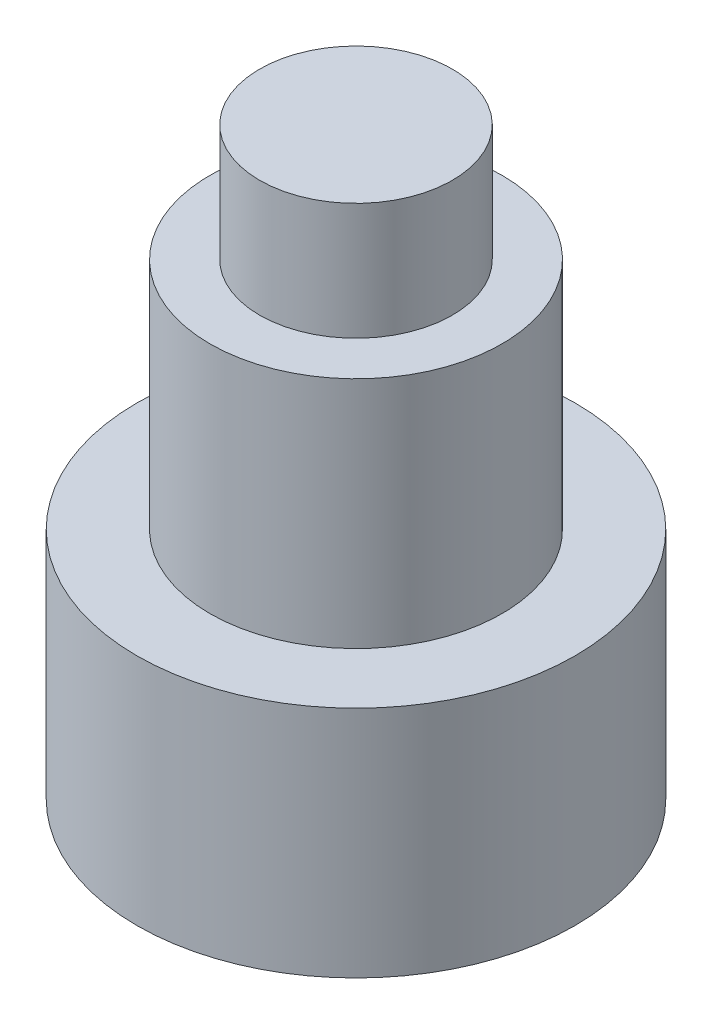
ISO-10303-21;
HEADER;
FILE_DESCRIPTION(('STEP AP214'),'2;1');
FILE_NAME('part.step','',(''),(''),'','','');
FILE_SCHEMA(('AUTOMOTIVE_DESIGN { 1 0 10303 214 1 1 1 1 }'));
ENDSEC;
DATA;
#1=APPLICATION_CONTEXT('core data for automotive mechanical design processes');
#2=APPLICATION_PROTOCOL_DEFINITION('international standard','automotive_design',2000,#1);
#3=PRODUCT_CONTEXT('',#1,'mechanical');
#4=PRODUCT('Part','Part','',(#3));
#5=PRODUCT_RELATED_PRODUCT_CATEGORY('part','',(#4));
#6=PRODUCT_DEFINITION_FORMATION('','',#4);
#7=PRODUCT_DEFINITION_CONTEXT('part definition',#1,'design');
#8=PRODUCT_DEFINITION('design','',#6,#7);
#9=PRODUCT_DEFINITION_SHAPE('','',#8);
#10=(LENGTH_UNIT() NAMED_UNIT(*) SI_UNIT(.MILLI.,.METRE.));
#11=(NAMED_UNIT(*) PLANE_ANGLE_UNIT() SI_UNIT($,.RADIAN.));
#12=(NAMED_UNIT(*) SI_UNIT($,.STERADIAN.) SOLID_ANGLE_UNIT());
#13=UNCERTAINTY_MEASURE_WITH_UNIT(LENGTH_MEASURE(1.E-05),#10,'distance_accuracy_value','');
#14=(GEOMETRIC_REPRESENTATION_CONTEXT(3) GLOBAL_UNCERTAINTY_ASSIGNED_CONTEXT((#13)) GLOBAL_UNIT_ASSIGNED_CONTEXT((#10,
#11,#12)) REPRESENTATION_CONTEXT('',''));
#15=CARTESIAN_POINT('',(0.,0.,0.));
#16=DIRECTION('',(0.,0.,1.));
#17=DIRECTION('',(1.,0.,0.));
#18=AXIS2_PLACEMENT_3D('',#15,#16,#17);
#19=CARTESIAN_POINT('',(0.,8.,0.));
#20=DIRECTION('',(0.,-1.,0.));
#21=DIRECTION('',(0.,0.,-1.));
#22=AXIS2_PLACEMENT_3D('',#19,#20,#21);
#23=CYLINDRICAL_SURFACE('',#22,3.75);
#24=CARTESIAN_POINT('',(0.,0.,0.));
#25=DIRECTION('',(0.,1.,0.));
#26=DIRECTION('',(0.,0.,1.));
#27=AXIS2_PLACEMENT_3D('',#24,#25,#26);
#28=CIRCLE('',#27,3.75);
#29=CARTESIAN_POINT('',(0.,0.,3.75));
#30=VERTEX_POINT('',#29);
#31=EDGE_CURVE('E40',#30,#30,#28,.T.);
#32=ORIENTED_EDGE('',*,*,#31,.T.);
#33=EDGE_LOOP('',(#32));
#34=FACE_BOUND('',#33,.T.);
#35=CARTESIAN_POINT('',(0.,4.,0.));
#36=DIRECTION('',(0.,1.,0.));
#37=DIRECTION('',(0.,0.,1.));
#38=AXIS2_PLACEMENT_3D('',#35,#36,#37);
#39=CIRCLE('',#38,3.75);
#40=CARTESIAN_POINT('',(0.,4.,3.75));
#41=VERTEX_POINT('',#40);
#42=EDGE_CURVE('E50',#41,#41,#39,.T.);
#43=ORIENTED_EDGE('',*,*,#42,.F.);
#44=EDGE_LOOP('',(#43));
#45=FACE_BOUND('',#44,.T.);
#46=ADVANCED_FACE('F37',(#34,#45),#23,.T.);
#47=CARTESIAN_POINT('',(0.,0.,0.));
#48=DIRECTION('',(0.,1.,0.));
#49=DIRECTION('',(0.,0.,1.));
#50=AXIS2_PLACEMENT_3D('',#47,#48,#49);
#51=PLANE('',#50);
#52=ORIENTED_EDGE('',*,*,#31,.F.);
#53=EDGE_LOOP('',(#52));
#54=FACE_BOUND('',#53,.T.);
#55=ADVANCED_FACE('F68',(#54),#51,.F.);
#56=CARTESIAN_POINT('',(0.,4.,0.));
#57=DIRECTION('',(0.,1.,0.));
#58=DIRECTION('',(0.,0.,1.));
#59=AXIS2_PLACEMENT_3D('',#56,#57,#58);
#60=PLANE('',#59);
#61=CARTESIAN_POINT('',(0.,4.,0.));
#62=DIRECTION('',(0.,1.,0.));
#63=DIRECTION('',(0.,0.,1.));
#64=AXIS2_PLACEMENT_3D('',#61,#62,#63);
#65=CIRCLE('',#64,2.5);
#66=CARTESIAN_POINT('',(0.,4.,2.5));
#67=VERTEX_POINT('',#66);
#68=EDGE_CURVE('E54',#67,#67,#65,.T.);
#69=ORIENTED_EDGE('',*,*,#68,.F.);
#70=EDGE_LOOP('',(#69));
#71=FACE_BOUND('',#70,.T.);
#72=ORIENTED_EDGE('',*,*,#42,.T.);
#73=EDGE_LOOP('',(#72));
#74=FACE_BOUND('',#73,.T.);
#75=ADVANCED_FACE('F65',(#71,#74),#60,.T.);
#76=CARTESIAN_POINT('',(0.,4.,0.));
#77=DIRECTION('',(0.,1.,0.));
#78=DIRECTION('',(0.,0.,1.));
#79=AXIS2_PLACEMENT_3D('',#76,#77,#78);
#80=CYLINDRICAL_SURFACE('',#79,2.5);
#81=ORIENTED_EDGE('',*,*,#68,.T.);
#82=EDGE_LOOP('',(#81));
#83=FACE_BOUND('',#82,.T.);
#84=CARTESIAN_POINT('',(0.,8.,0.));
#85=DIRECTION('',(0.,1.,0.));
#86=DIRECTION('',(0.,0.,1.));
#87=AXIS2_PLACEMENT_3D('',#84,#85,#86);
#88=CIRCLE('',#87,2.5);
#89=CARTESIAN_POINT('',(0.,8.,2.5));
#90=VERTEX_POINT('',#89);
#91=EDGE_CURVE('E58',#90,#90,#88,.T.);
#92=ORIENTED_EDGE('',*,*,#91,.F.);
#93=EDGE_LOOP('',(#92));
#94=FACE_BOUND('',#93,.T.);
#95=ADVANCED_FACE('F80',(#83,#94),#80,.T.);
#96=CARTESIAN_POINT('',(0.,8.,0.));
#97=DIRECTION('',(0.,1.,0.));
#98=DIRECTION('',(0.,0.,1.));
#99=AXIS2_PLACEMENT_3D('',#96,#97,#98);
#100=PLANE('',#99);
#101=CARTESIAN_POINT('',(0.,8.,0.));
#102=DIRECTION('',(0.,1.,0.));
#103=DIRECTION('',(0.,0.,1.));
#104=AXIS2_PLACEMENT_3D('',#101,#102,#103);
#105=CIRCLE('',#104,1.65);
#106=CARTESIAN_POINT('',(0.,8.,1.65));
#107=VERTEX_POINT('',#106);
#108=EDGE_CURVE('E10',#107,#107,#105,.T.);
#109=ORIENTED_EDGE('',*,*,#108,.F.);
#110=EDGE_LOOP('',(#109));
#111=FACE_BOUND('',#110,.T.);
#112=ORIENTED_EDGE('',*,*,#91,.T.);
#113=EDGE_LOOP('',(#112));
#114=FACE_BOUND('',#113,.T.);
#115=ADVANCED_FACE('F84',(#111,#114),#100,.T.);
#116=CARTESIAN_POINT('',(0.,10.,0.));
#117=DIRECTION('',(0.,-1.,0.));
#118=DIRECTION('',(0.,0.,-1.));
#119=AXIS2_PLACEMENT_3D('',#116,#117,#118);
#120=CYLINDRICAL_SURFACE('',#119,1.65);
#121=CARTESIAN_POINT('',(0.,10.,0.));
#122=DIRECTION('',(0.,1.,0.));
#123=DIRECTION('',(0.,0.,1.));
#124=AXIS2_PLACEMENT_3D('',#121,#122,#123);
#125=CIRCLE('',#124,1.65);
#126=CARTESIAN_POINT('',(0.,10.,1.65));
#127=VERTEX_POINT('',#126);
#128=EDGE_CURVE('E53',#127,#127,#125,.T.);
#129=ORIENTED_EDGE('',*,*,#128,.F.);
#130=EDGE_LOOP('',(#129));
#131=FACE_BOUND('',#130,.T.);
#132=ORIENTED_EDGE('',*,*,#108,.T.);
#133=EDGE_LOOP('',(#132));
#134=FACE_BOUND('',#133,.T.);
#135=ADVANCED_FACE('F86',(#131,#134),#120,.T.);
#136=CARTESIAN_POINT('',(0.,10.,0.));
#137=DIRECTION('',(0.,1.,0.));
#138=DIRECTION('',(0.,0.,1.));
#139=AXIS2_PLACEMENT_3D('',#136,#137,#138);
#140=PLANE('',#139);
#141=ORIENTED_EDGE('',*,*,#128,.T.);
#142=EDGE_LOOP('',(#141));
#143=FACE_BOUND('',#142,.T.);
#144=ADVANCED_FACE('F94',(#143),#140,.T.);
#145=CLOSED_SHELL('',(#46,#55,#75,#95,#115,#135,#144));
#146=MANIFOLD_SOLID_BREP('B2',#145);
#147=ADVANCED_BREP_SHAPE_REPRESENTATION('',(#18,#146),#14);
#148=SHAPE_DEFINITION_REPRESENTATION(#9,#147);
ENDSEC;
END-ISO-10303-21;
